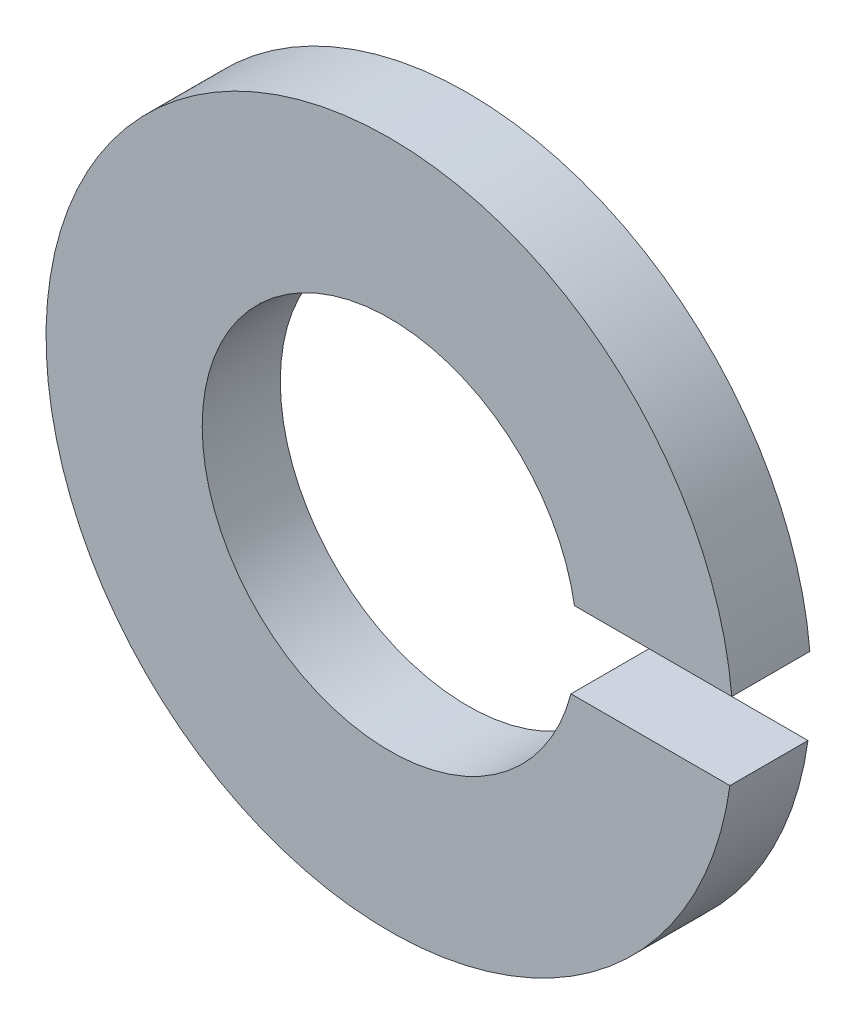
ISO-10303-21;
HEADER;
FILE_DESCRIPTION(('STEP AP214'),'2;1');
FILE_NAME('part.step','',(''),(''),'','','');
FILE_SCHEMA(('AUTOMOTIVE_DESIGN { 1 0 10303 214 1 1 1 1 }'));
ENDSEC;
DATA;
#1=APPLICATION_CONTEXT('core data for automotive mechanical design processes');
#2=APPLICATION_PROTOCOL_DEFINITION('international standard','automotive_design',2000,#1);
#3=PRODUCT_CONTEXT('',#1,'mechanical');
#4=PRODUCT('Part','Part','',(#3));
#5=PRODUCT_RELATED_PRODUCT_CATEGORY('part','',(#4));
#6=PRODUCT_DEFINITION_FORMATION('','',#4);
#7=PRODUCT_DEFINITION_CONTEXT('part definition',#1,'design');
#8=PRODUCT_DEFINITION('design','',#6,#7);
#9=PRODUCT_DEFINITION_SHAPE('','',#8);
#10=(LENGTH_UNIT() NAMED_UNIT(*) SI_UNIT(.MILLI.,.METRE.));
#11=(NAMED_UNIT(*) PLANE_ANGLE_UNIT() SI_UNIT($,.RADIAN.));
#12=(NAMED_UNIT(*) SI_UNIT($,.STERADIAN.) SOLID_ANGLE_UNIT());
#13=UNCERTAINTY_MEASURE_WITH_UNIT(LENGTH_MEASURE(1.E-05),#10,'distance_accuracy_value','');
#14=(GEOMETRIC_REPRESENTATION_CONTEXT(3) GLOBAL_UNCERTAINTY_ASSIGNED_CONTEXT((#13)) GLOBAL_UNIT_ASSIGNED_CONTEXT((#10,
#11,#12)) REPRESENTATION_CONTEXT('',''));
#15=CARTESIAN_POINT('',(0.,0.,0.));
#16=DIRECTION('',(0.,0.,1.));
#17=DIRECTION('',(1.,0.,0.));
#18=AXIS2_PLACEMENT_3D('',#15,#16,#17);
#19=CARTESIAN_POINT('',(0.,0.,0.5));
#20=DIRECTION('',(0.,0.,-1.));
#21=DIRECTION('',(-1.,0.,0.));
#22=AXIS2_PLACEMENT_3D('',#19,#20,#21);
#23=CYLINDRICAL_SURFACE('',#22,1.2);
#24=CARTESIAN_POINT('',(0.,0.,0.));
#25=DIRECTION('',(0.,0.,1.));
#26=DIRECTION('',(1.,0.,0.));
#27=AXIS2_PLACEMENT_3D('',#24,#25,#26);
#28=CIRCLE('',#27,1.2);
#29=CARTESIAN_POINT('',(1.18358917176155,0.197779353039688,0.));
#30=VERTEX_POINT('',#29);
#31=CARTESIAN_POINT('',(1.16131937060866,-0.302220646960312,0.));
#32=VERTEX_POINT('',#31);
#33=EDGE_CURVE('E96',#30,#32,#28,.T.);
#34=ORIENTED_EDGE('',*,*,#33,.F.);
#35=DIRECTION('',(0.,0.,-1.));
#36=VECTOR('',#35,1.);
#37=CARTESIAN_POINT('',(1.18358917176155,0.197779353039688,0.5));
#38=LINE('',#37,#36);
#39=CARTESIAN_POINT('',(1.18358917176155,0.197779353039688,0.5));
#40=VERTEX_POINT('',#39);
#41=EDGE_CURVE('E11',#40,#30,#38,.T.);
#42=ORIENTED_EDGE('',*,*,#41,.F.);
#43=CARTESIAN_POINT('',(0.,0.,0.5));
#44=DIRECTION('',(0.,0.,1.));
#45=DIRECTION('',(1.,0.,0.));
#46=AXIS2_PLACEMENT_3D('',#43,#44,#45);
#47=CIRCLE('',#46,1.2);
#48=CARTESIAN_POINT('',(1.16131937060866,-0.302220646960312,0.5));
#49=VERTEX_POINT('',#48);
#50=EDGE_CURVE('E90',#40,#49,#47,.T.);
#51=ORIENTED_EDGE('',*,*,#50,.T.);
#52=DIRECTION('',(0.,0.,-1.));
#53=VECTOR('',#52,1.);
#54=CARTESIAN_POINT('',(1.16131937060866,-0.302220646960312,0.5));
#55=LINE('',#54,#53);
#56=EDGE_CURVE('E71',#49,#32,#55,.T.);
#57=ORIENTED_EDGE('',*,*,#56,.T.);
#58=EDGE_LOOP('',(#34,#42,#51,#57));
#59=FACE_BOUND('',#58,.T.);
#60=ADVANCED_FACE('F33',(#59),#23,.F.);
#61=CARTESIAN_POINT('',(0.,0.197779353039688,0.5));
#62=DIRECTION('',(0.,-1.,0.));
#63=DIRECTION('',(0.,0.,-1.));
#64=AXIS2_PLACEMENT_3D('',#61,#62,#63);
#65=PLANE('',#64);
#66=DIRECTION('',(-1.,0.,0.));
#67=VECTOR('',#66,1.);
#68=CARTESIAN_POINT('',(0.,0.197779353039688,0.));
#69=LINE('',#68,#67);
#70=CARTESIAN_POINT('',(2.19109181174847,0.197779353039688,0.));
#71=VERTEX_POINT('',#70);
#72=EDGE_CURVE('E84',#71,#30,#69,.T.);
#73=ORIENTED_EDGE('',*,*,#72,.F.);
#74=DIRECTION('',(0.,0.,-1.));
#75=VECTOR('',#74,1.);
#76=CARTESIAN_POINT('',(2.19109181174847,0.197779353039688,0.5));
#77=LINE('',#76,#75);
#78=CARTESIAN_POINT('',(2.19109181174847,0.197779353039688,0.5));
#79=VERTEX_POINT('',#78);
#80=EDGE_CURVE('E41',#79,#71,#77,.T.);
#81=ORIENTED_EDGE('',*,*,#80,.F.);
#82=DIRECTION('',(-1.,0.,0.));
#83=VECTOR('',#82,1.);
#84=CARTESIAN_POINT('',(0.,0.197779353039688,0.5));
#85=LINE('',#84,#83);
#86=EDGE_CURVE('E82',#79,#40,#85,.T.);
#87=ORIENTED_EDGE('',*,*,#86,.T.);
#88=ORIENTED_EDGE('',*,*,#41,.T.);
#89=EDGE_LOOP('',(#73,#81,#87,#88));
#90=FACE_BOUND('',#89,.T.);
#91=ADVANCED_FACE('F80',(#90),#65,.T.);
#92=CARTESIAN_POINT('',(0.,0.,0.5));
#93=DIRECTION('',(0.,0.,-1.));
#94=DIRECTION('',(-1.,0.,0.));
#95=AXIS2_PLACEMENT_3D('',#92,#93,#94);
#96=CYLINDRICAL_SURFACE('',#95,2.2);
#97=CARTESIAN_POINT('',(0.,0.,0.));
#98=DIRECTION('',(0.,0.,1.));
#99=DIRECTION('',(1.,0.,0.));
#100=AXIS2_PLACEMENT_3D('',#97,#98,#99);
#101=CIRCLE('',#100,2.2);
#102=CARTESIAN_POINT('',(2.17914264805012,-0.302220646960312,0.));
#103=VERTEX_POINT('',#102);
#104=EDGE_CURVE('E64',#71,#103,#101,.T.);
#105=ORIENTED_EDGE('',*,*,#104,.T.);
#106=DIRECTION('',(0.,0.,-1.));
#107=VECTOR('',#106,1.);
#108=CARTESIAN_POINT('',(2.17914264805012,-0.302220646960312,0.5));
#109=LINE('',#108,#107);
#110=CARTESIAN_POINT('',(2.17914264805012,-0.302220646960312,0.5));
#111=VERTEX_POINT('',#110);
#112=EDGE_CURVE('E85',#111,#103,#109,.T.);
#113=ORIENTED_EDGE('',*,*,#112,.F.);
#114=CARTESIAN_POINT('',(0.,0.,0.5));
#115=DIRECTION('',(0.,0.,1.));
#116=DIRECTION('',(1.,0.,0.));
#117=AXIS2_PLACEMENT_3D('',#114,#115,#116);
#118=CIRCLE('',#117,2.2);
#119=EDGE_CURVE('E86',#79,#111,#118,.T.);
#120=ORIENTED_EDGE('',*,*,#119,.F.);
#121=ORIENTED_EDGE('',*,*,#80,.T.);
#122=EDGE_LOOP('',(#105,#113,#120,#121));
#123=FACE_BOUND('',#122,.T.);
#124=ADVANCED_FACE('F87',(#123),#96,.T.);
#125=CARTESIAN_POINT('',(0.,-0.302220646960312,0.5));
#126=DIRECTION('',(0.,-1.,0.));
#127=DIRECTION('',(0.,0.,-1.));
#128=AXIS2_PLACEMENT_3D('',#125,#126,#127);
#129=PLANE('',#128);
#130=DIRECTION('',(-1.,0.,0.));
#131=VECTOR('',#130,1.);
#132=CARTESIAN_POINT('',(0.,-0.302220646960312,0.));
#133=LINE('',#132,#131);
#134=EDGE_CURVE('E92',#103,#32,#133,.T.);
#135=ORIENTED_EDGE('',*,*,#134,.T.);
#136=ORIENTED_EDGE('',*,*,#56,.F.);
#137=DIRECTION('',(-1.,0.,0.));
#138=VECTOR('',#137,1.);
#139=CARTESIAN_POINT('',(0.,-0.302220646960312,0.5));
#140=LINE('',#139,#138);
#141=EDGE_CURVE('E49',#111,#49,#140,.T.);
#142=ORIENTED_EDGE('',*,*,#141,.F.);
#143=ORIENTED_EDGE('',*,*,#112,.T.);
#144=EDGE_LOOP('',(#135,#136,#142,#143));
#145=FACE_BOUND('',#144,.T.);
#146=ADVANCED_FACE('F105',(#145),#129,.F.);
#147=CARTESIAN_POINT('',(0.,0.,0.5));
#148=DIRECTION('',(0.,0.,1.));
#149=DIRECTION('',(1.,0.,0.));
#150=AXIS2_PLACEMENT_3D('',#147,#148,#149);
#151=PLANE('',#150);
#152=ORIENTED_EDGE('',*,*,#50,.F.);
#153=ORIENTED_EDGE('',*,*,#86,.F.);
#154=ORIENTED_EDGE('',*,*,#119,.T.);
#155=ORIENTED_EDGE('',*,*,#141,.T.);
#156=EDGE_LOOP('',(#152,#153,#154,#155));
#157=FACE_BOUND('',#156,.T.);
#158=ADVANCED_FACE('F89',(#157),#151,.T.);
#159=CARTESIAN_POINT('',(0.,0.,0.));
#160=DIRECTION('',(0.,0.,1.));
#161=DIRECTION('',(1.,0.,0.));
#162=AXIS2_PLACEMENT_3D('',#159,#160,#161);
#163=PLANE('',#162);
#164=ORIENTED_EDGE('',*,*,#33,.T.);
#165=ORIENTED_EDGE('',*,*,#134,.F.);
#166=ORIENTED_EDGE('',*,*,#104,.F.);
#167=ORIENTED_EDGE('',*,*,#72,.T.);
#168=EDGE_LOOP('',(#164,#165,#166,#167));
#169=FACE_BOUND('',#168,.T.);
#170=ADVANCED_FACE('F107',(#169),#163,.F.);
#171=CLOSED_SHELL('',(#60,#91,#124,#146,#158,#170));
#172=MANIFOLD_SOLID_BREP('B2',#171);
#173=ADVANCED_BREP_SHAPE_REPRESENTATION('',(#18,#172),#14);
#174=SHAPE_DEFINITION_REPRESENTATION(#9,#173);
ENDSEC;
END-ISO-10303-21;
